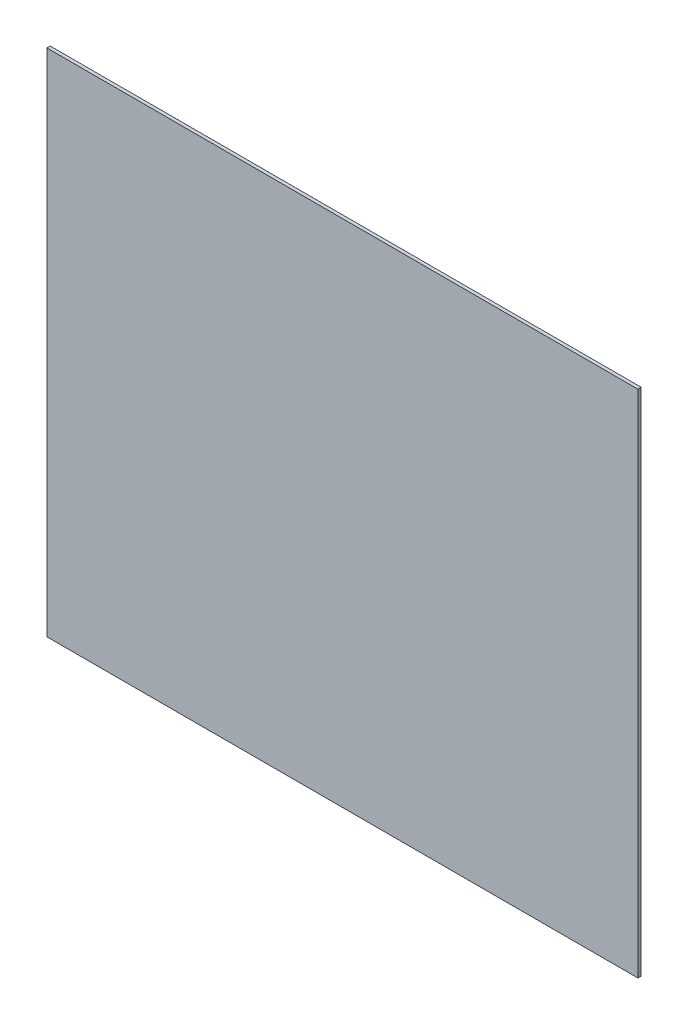
ISO-10303-21;
HEADER;
FILE_DESCRIPTION(('STEP AP214'),'2;1');
FILE_NAME('part.step','',(''),(''),'','','');
FILE_SCHEMA(('AUTOMOTIVE_DESIGN { 1 0 10303 214 1 1 1 1 }'));
ENDSEC;
DATA;
#1=APPLICATION_CONTEXT('core data for automotive mechanical design processes');
#2=APPLICATION_PROTOCOL_DEFINITION('international standard','automotive_design',2000,#1);
#3=PRODUCT_CONTEXT('',#1,'mechanical');
#4=PRODUCT('Part','Part','',(#3));
#5=PRODUCT_RELATED_PRODUCT_CATEGORY('part','',(#4));
#6=PRODUCT_DEFINITION_FORMATION('','',#4);
#7=PRODUCT_DEFINITION_CONTEXT('part definition',#1,'design');
#8=PRODUCT_DEFINITION('design','',#6,#7);
#9=PRODUCT_DEFINITION_SHAPE('','',#8);
#10=(LENGTH_UNIT() NAMED_UNIT(*) SI_UNIT(.MILLI.,.METRE.));
#11=(NAMED_UNIT(*) PLANE_ANGLE_UNIT() SI_UNIT($,.RADIAN.));
#12=(NAMED_UNIT(*) SI_UNIT($,.STERADIAN.) SOLID_ANGLE_UNIT());
#13=UNCERTAINTY_MEASURE_WITH_UNIT(LENGTH_MEASURE(1.E-05),#10,'distance_accuracy_value','');
#14=(GEOMETRIC_REPRESENTATION_CONTEXT(3) GLOBAL_UNCERTAINTY_ASSIGNED_CONTEXT((#13)) GLOBAL_UNIT_ASSIGNED_CONTEXT((#10,
#11,#12)) REPRESENTATION_CONTEXT('',''));
#15=CARTESIAN_POINT('',(0.,0.,0.));
#16=DIRECTION('',(0.,0.,1.));
#17=DIRECTION('',(1.,0.,0.));
#18=AXIS2_PLACEMENT_3D('',#15,#16,#17);
#19=CARTESIAN_POINT('',(-67.1196787180551,30.2524928714712,3.));
#20=DIRECTION('',(1.,0.,0.));
#21=DIRECTION('',(0.,1.,0.));
#22=AXIS2_PLACEMENT_3D('',#19,#20,#21);
#23=PLANE('',#22);
#24=DIRECTION('',(0.,-1.,0.));
#25=VECTOR('',#24,1.);
#26=CARTESIAN_POINT('',(-67.1196787180551,30.2524928714712,0.));
#27=LINE('',#26,#25);
#28=CARTESIAN_POINT('',(-67.1196787180551,30.2524928714712,0.));
#29=VERTEX_POINT('',#28);
#30=CARTESIAN_POINT('',(-67.119678718055,-435.747507128529,0.));
#31=VERTEX_POINT('',#30);
#32=EDGE_CURVE('E96',#29,#31,#27,.T.);
#33=ORIENTED_EDGE('',*,*,#32,.T.);
#34=DIRECTION('',(0.,0.,-1.));
#35=VECTOR('',#34,1.);
#36=CARTESIAN_POINT('',(-67.119678718055,-435.747507128529,3.));
#37=LINE('',#36,#35);
#38=CARTESIAN_POINT('',(-67.119678718055,-435.747507128529,3.));
#39=VERTEX_POINT('',#38);
#40=EDGE_CURVE('E11',#39,#31,#37,.T.);
#41=ORIENTED_EDGE('',*,*,#40,.F.);
#42=DIRECTION('',(0.,-1.,0.));
#43=VECTOR('',#42,1.);
#44=CARTESIAN_POINT('',(-67.1196787180551,30.2524928714712,3.));
#45=LINE('',#44,#43);
#46=CARTESIAN_POINT('',(-67.1196787180551,30.2524928714712,3.));
#47=VERTEX_POINT('',#46);
#48=EDGE_CURVE('E84',#47,#39,#45,.T.);
#49=ORIENTED_EDGE('',*,*,#48,.F.);
#50=DIRECTION('',(0.,0.,-1.));
#51=VECTOR('',#50,1.);
#52=CARTESIAN_POINT('',(-67.1196787180551,30.2524928714712,3.));
#53=LINE('',#52,#51);
#54=EDGE_CURVE('E92',#47,#29,#53,.T.);
#55=ORIENTED_EDGE('',*,*,#54,.T.);
#56=EDGE_LOOP('',(#33,#41,#49,#55));
#57=FACE_BOUND('',#56,.T.);
#58=ADVANCED_FACE('F33',(#57),#23,.F.);
#59=CARTESIAN_POINT('',(-67.119678718055,-435.747507128529,3.));
#60=DIRECTION('',(0.,1.,0.));
#61=DIRECTION('',(0.,0.,1.));
#62=AXIS2_PLACEMENT_3D('',#59,#60,#61);
#63=PLANE('',#62);
#64=DIRECTION('',(1.,0.,0.));
#65=VECTOR('',#64,1.);
#66=CARTESIAN_POINT('',(-67.119678718055,-435.747507128529,0.));
#67=LINE('',#66,#65);
#68=CARTESIAN_POINT('',(472.880321281945,-435.747507128529,0.));
#69=VERTEX_POINT('',#68);
#70=EDGE_CURVE('E88',#31,#69,#67,.T.);
#71=ORIENTED_EDGE('',*,*,#70,.T.);
#72=DIRECTION('',(0.,0.,-1.));
#73=VECTOR('',#72,1.);
#74=CARTESIAN_POINT('',(472.880321281945,-435.747507128529,3.));
#75=LINE('',#74,#73);
#76=CARTESIAN_POINT('',(472.880321281945,-435.747507128529,3.));
#77=VERTEX_POINT('',#76);
#78=EDGE_CURVE('E41',#77,#69,#75,.T.);
#79=ORIENTED_EDGE('',*,*,#78,.F.);
#80=DIRECTION('',(1.,0.,0.));
#81=VECTOR('',#80,1.);
#82=CARTESIAN_POINT('',(-67.119678718055,-435.747507128529,3.));
#83=LINE('',#82,#81);
#84=EDGE_CURVE('E79',#39,#77,#83,.T.);
#85=ORIENTED_EDGE('',*,*,#84,.F.);
#86=ORIENTED_EDGE('',*,*,#40,.T.);
#87=EDGE_LOOP('',(#71,#79,#85,#86));
#88=FACE_BOUND('',#87,.T.);
#89=ADVANCED_FACE('F87',(#88),#63,.F.);
#90=CARTESIAN_POINT('',(472.880321281945,30.2524928714712,3.));
#91=DIRECTION('',(-1.,0.,0.));
#92=DIRECTION('',(0.,-1.,0.));
#93=AXIS2_PLACEMENT_3D('',#90,#91,#92);
#94=PLANE('',#93);
#95=DIRECTION('',(0.,1.,0.));
#96=VECTOR('',#95,1.);
#97=CARTESIAN_POINT('',(472.880321281945,30.2524928714712,0.));
#98=LINE('',#97,#96);
#99=CARTESIAN_POINT('',(472.880321281945,30.2524928714712,0.));
#100=VERTEX_POINT('',#99);
#101=EDGE_CURVE('E66',#69,#100,#98,.T.);
#102=ORIENTED_EDGE('',*,*,#101,.T.);
#103=DIRECTION('',(0.,0.,-1.));
#104=VECTOR('',#103,1.);
#105=CARTESIAN_POINT('',(472.880321281945,30.2524928714712,3.));
#106=LINE('',#105,#104);
#107=CARTESIAN_POINT('',(472.880321281945,30.2524928714712,3.));
#108=VERTEX_POINT('',#107);
#109=EDGE_CURVE('E89',#108,#100,#106,.T.);
#110=ORIENTED_EDGE('',*,*,#109,.F.);
#111=DIRECTION('',(0.,1.,0.));
#112=VECTOR('',#111,1.);
#113=CARTESIAN_POINT('',(472.880321281945,30.2524928714712,3.));
#114=LINE('',#113,#112);
#115=EDGE_CURVE('E82',#77,#108,#114,.T.);
#116=ORIENTED_EDGE('',*,*,#115,.F.);
#117=ORIENTED_EDGE('',*,*,#78,.T.);
#118=EDGE_LOOP('',(#102,#110,#116,#117));
#119=FACE_BOUND('',#118,.T.);
#120=ADVANCED_FACE('F90',(#119),#94,.F.);
#121=CARTESIAN_POINT('',(-67.1196787180551,30.2524928714712,3.));
#122=DIRECTION('',(0.,-1.,0.));
#123=DIRECTION('',(0.,0.,-1.));
#124=AXIS2_PLACEMENT_3D('',#121,#122,#123);
#125=PLANE('',#124);
#126=DIRECTION('',(-1.,0.,0.));
#127=VECTOR('',#126,1.);
#128=CARTESIAN_POINT('',(-67.1196787180551,30.2524928714712,0.));
#129=LINE('',#128,#127);
#130=EDGE_CURVE('E72',#100,#29,#129,.T.);
#131=ORIENTED_EDGE('',*,*,#130,.T.);
#132=ORIENTED_EDGE('',*,*,#54,.F.);
#133=DIRECTION('',(-1.,0.,0.));
#134=VECTOR('',#133,1.);
#135=CARTESIAN_POINT('',(-67.1196787180551,30.2524928714712,3.));
#136=LINE('',#135,#134);
#137=EDGE_CURVE('E49',#108,#47,#136,.T.);
#138=ORIENTED_EDGE('',*,*,#137,.F.);
#139=ORIENTED_EDGE('',*,*,#109,.T.);
#140=EDGE_LOOP('',(#131,#132,#138,#139));
#141=FACE_BOUND('',#140,.T.);
#142=ADVANCED_FACE('F103',(#141),#125,.F.);
#143=CARTESIAN_POINT('',(0.,0.,3.));
#144=DIRECTION('',(0.,0.,1.));
#145=DIRECTION('',(1.,0.,0.));
#146=AXIS2_PLACEMENT_3D('',#143,#144,#145);
#147=PLANE('',#146);
#148=ORIENTED_EDGE('',*,*,#48,.T.);
#149=ORIENTED_EDGE('',*,*,#84,.T.);
#150=ORIENTED_EDGE('',*,*,#115,.T.);
#151=ORIENTED_EDGE('',*,*,#137,.T.);
#152=EDGE_LOOP('',(#148,#149,#150,#151));
#153=FACE_BOUND('',#152,.T.);
#154=ADVANCED_FACE('F80',(#153),#147,.T.);
#155=CARTESIAN_POINT('',(0.,0.,0.));
#156=DIRECTION('',(0.,0.,1.));
#157=DIRECTION('',(1.,0.,0.));
#158=AXIS2_PLACEMENT_3D('',#155,#156,#157);
#159=PLANE('',#158);
#160=ORIENTED_EDGE('',*,*,#32,.F.);
#161=ORIENTED_EDGE('',*,*,#130,.F.);
#162=ORIENTED_EDGE('',*,*,#101,.F.);
#163=ORIENTED_EDGE('',*,*,#70,.F.);
#164=EDGE_LOOP('',(#160,#161,#162,#163));
#165=FACE_BOUND('',#164,.T.);
#166=ADVANCED_FACE('F106',(#165),#159,.F.);
#167=CLOSED_SHELL('',(#58,#89,#120,#142,#154,#166));
#168=MANIFOLD_SOLID_BREP('B2',#167);
#169=ADVANCED_BREP_SHAPE_REPRESENTATION('',(#18,#168),#14);
#170=SHAPE_DEFINITION_REPRESENTATION(#9,#169);
ENDSEC;
END-ISO-10303-21;
